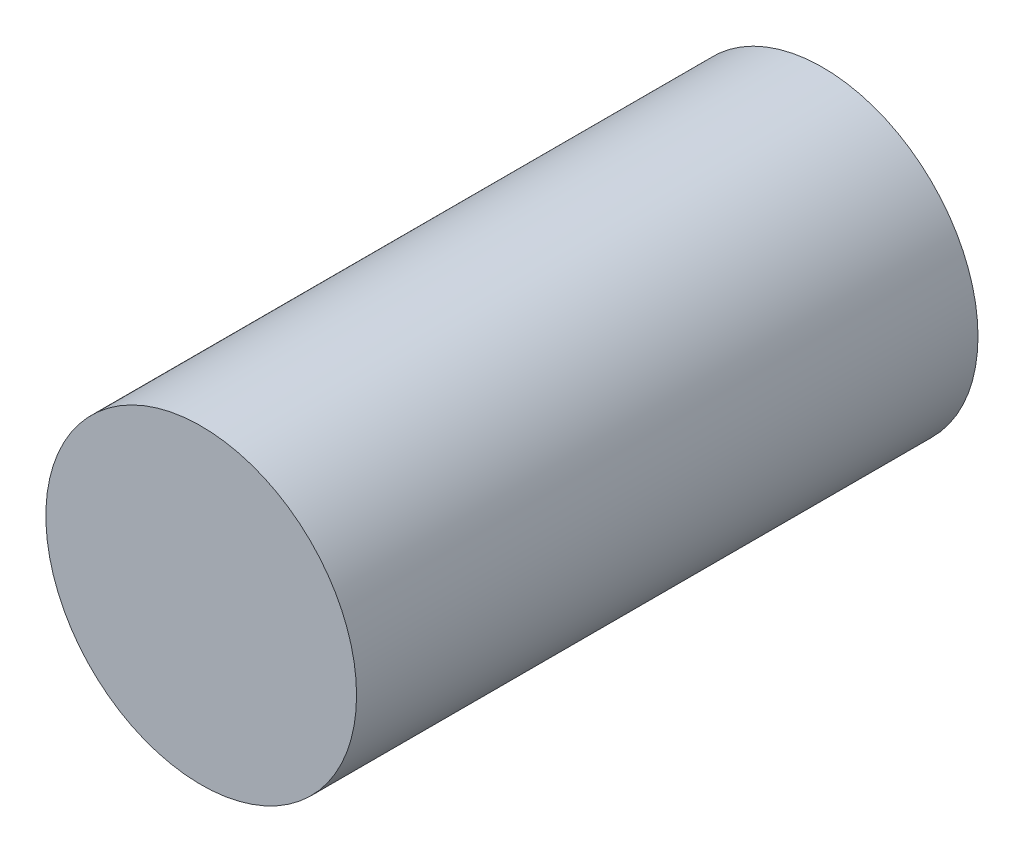
ISO-10303-21;
HEADER;
FILE_DESCRIPTION(('STEP AP214'),'2;1');
FILE_NAME('part.step','',(''),(''),'','','');
FILE_SCHEMA(('AUTOMOTIVE_DESIGN { 1 0 10303 214 1 1 1 1 }'));
ENDSEC;
DATA;
#1=APPLICATION_CONTEXT('core data for automotive mechanical design processes');
#2=APPLICATION_PROTOCOL_DEFINITION('international standard','automotive_design',2000,#1);
#3=PRODUCT_CONTEXT('',#1,'mechanical');
#4=PRODUCT('Part','Part','',(#3));
#5=PRODUCT_RELATED_PRODUCT_CATEGORY('part','',(#4));
#6=PRODUCT_DEFINITION_FORMATION('','',#4);
#7=PRODUCT_DEFINITION_CONTEXT('part definition',#1,'design');
#8=PRODUCT_DEFINITION('design','',#6,#7);
#9=PRODUCT_DEFINITION_SHAPE('','',#8);
#10=(LENGTH_UNIT() NAMED_UNIT(*) SI_UNIT(.MILLI.,.METRE.));
#11=(NAMED_UNIT(*) PLANE_ANGLE_UNIT() SI_UNIT($,.RADIAN.));
#12=(NAMED_UNIT(*) SI_UNIT($,.STERADIAN.) SOLID_ANGLE_UNIT());
#13=UNCERTAINTY_MEASURE_WITH_UNIT(LENGTH_MEASURE(1.E-05),#10,'distance_accuracy_value','');
#14=(GEOMETRIC_REPRESENTATION_CONTEXT(3) GLOBAL_UNCERTAINTY_ASSIGNED_CONTEXT((#13)) GLOBAL_UNIT_ASSIGNED_CONTEXT((#10,
#11,#12)) REPRESENTATION_CONTEXT('',''));
#15=CARTESIAN_POINT('',(0.,0.,0.));
#16=DIRECTION('',(0.,0.,1.));
#17=DIRECTION('',(1.,0.,0.));
#18=AXIS2_PLACEMENT_3D('',#15,#16,#17);
#19=CARTESIAN_POINT('',(0.,0.,34.));
#20=DIRECTION('',(0.,0.,-1.));
#21=DIRECTION('',(-1.,0.,0.));
#22=AXIS2_PLACEMENT_3D('',#19,#20,#21);
#23=CYLINDRICAL_SURFACE('',#22,8.5);
#24=CARTESIAN_POINT('',(0.,0.,34.));
#25=DIRECTION('',(0.,0.,1.));
#26=DIRECTION('',(1.,0.,0.));
#27=AXIS2_PLACEMENT_3D('',#24,#25,#26);
#28=CIRCLE('',#27,8.5);
#29=CARTESIAN_POINT('',(8.5,0.,34.));
#30=VERTEX_POINT('',#29);
#31=EDGE_CURVE('E10',#30,#30,#28,.T.);
#32=ORIENTED_EDGE('',*,*,#31,.F.);
#33=EDGE_LOOP('',(#32));
#34=FACE_BOUND('',#33,.T.);
#35=CARTESIAN_POINT('',(0.,0.,0.));
#36=DIRECTION('',(0.,0.,1.));
#37=DIRECTION('',(1.,0.,0.));
#38=AXIS2_PLACEMENT_3D('',#35,#36,#37);
#39=CIRCLE('',#38,8.5);
#40=CARTESIAN_POINT('',(8.5,0.,0.));
#41=VERTEX_POINT('',#40);
#42=EDGE_CURVE('E34',#41,#41,#39,.T.);
#43=ORIENTED_EDGE('',*,*,#42,.T.);
#44=EDGE_LOOP('',(#43));
#45=FACE_BOUND('',#44,.T.);
#46=ADVANCED_FACE('F31',(#34,#45),#23,.T.);
#47=CARTESIAN_POINT('',(0.,0.,34.));
#48=DIRECTION('',(0.,0.,1.));
#49=DIRECTION('',(1.,0.,0.));
#50=AXIS2_PLACEMENT_3D('',#47,#48,#49);
#51=PLANE('',#50);
#52=ORIENTED_EDGE('',*,*,#31,.T.);
#53=EDGE_LOOP('',(#52));
#54=FACE_BOUND('',#53,.T.);
#55=ADVANCED_FACE('F46',(#54),#51,.T.);
#56=CARTESIAN_POINT('',(0.,0.,0.));
#57=DIRECTION('',(0.,0.,1.));
#58=DIRECTION('',(1.,0.,0.));
#59=AXIS2_PLACEMENT_3D('',#56,#57,#58);
#60=PLANE('',#59);
#61=ORIENTED_EDGE('',*,*,#42,.F.);
#62=EDGE_LOOP('',(#61));
#63=FACE_BOUND('',#62,.T.);
#64=ADVANCED_FACE('F44',(#63),#60,.F.);
#65=CLOSED_SHELL('',(#46,#55,#64));
#66=MANIFOLD_SOLID_BREP('B2',#65);
#67=ADVANCED_BREP_SHAPE_REPRESENTATION('',(#18,#66),#14);
#68=SHAPE_DEFINITION_REPRESENTATION(#9,#67);
ENDSEC;
END-ISO-10303-21;
